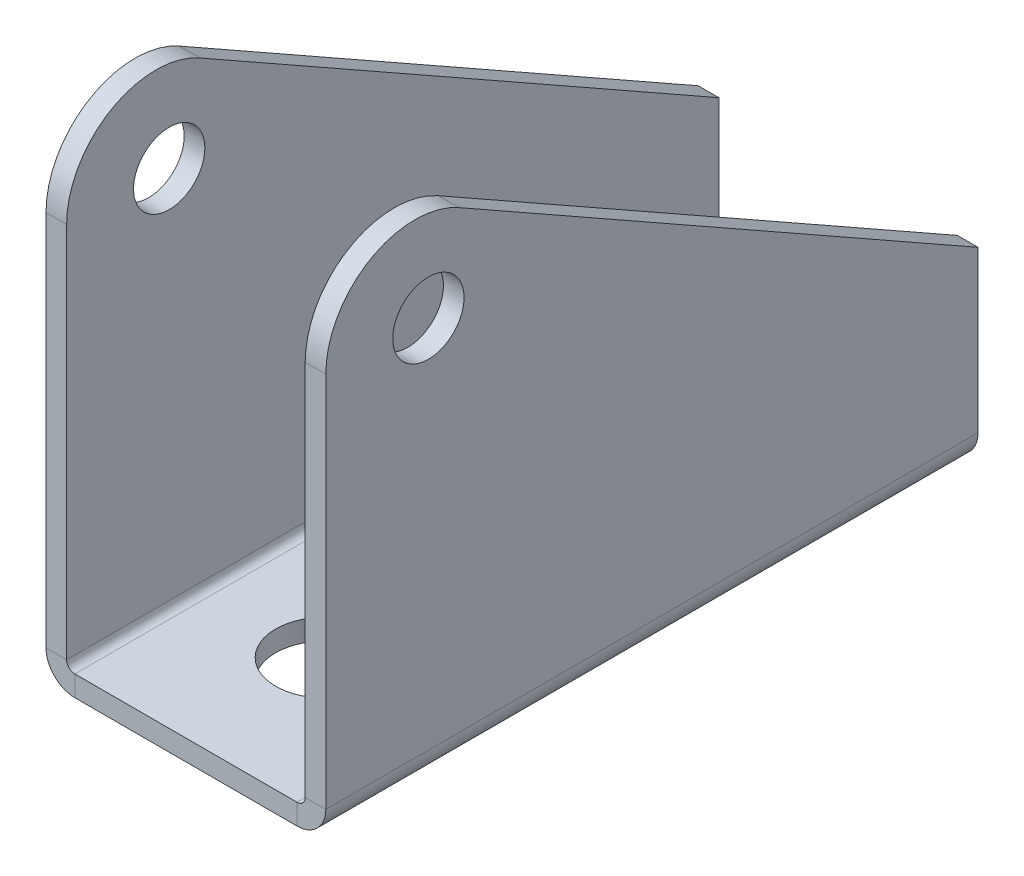
ISO-10303-21;
HEADER;
FILE_DESCRIPTION(('STEP AP214'),'2;1');
FILE_NAME('part.step','',(''),(''),'','','');
FILE_SCHEMA(('AUTOMOTIVE_DESIGN { 1 0 10303 214 1 1 1 1 }'));
ENDSEC;
DATA;
#1=APPLICATION_CONTEXT('core data for automotive mechanical design processes');
#2=APPLICATION_PROTOCOL_DEFINITION('international standard','automotive_design',2000,#1);
#3=PRODUCT_CONTEXT('',#1,'mechanical');
#4=PRODUCT('Part','Part','',(#3));
#5=PRODUCT_RELATED_PRODUCT_CATEGORY('part','',(#4));
#6=PRODUCT_DEFINITION_FORMATION('','',#4);
#7=PRODUCT_DEFINITION_CONTEXT('part definition',#1,'design');
#8=PRODUCT_DEFINITION('design','',#6,#7);
#9=PRODUCT_DEFINITION_SHAPE('','',#8);
#10=(LENGTH_UNIT() NAMED_UNIT(*) SI_UNIT(.MILLI.,.METRE.));
#11=(NAMED_UNIT(*) PLANE_ANGLE_UNIT() SI_UNIT($,.RADIAN.));
#12=(NAMED_UNIT(*) SI_UNIT($,.STERADIAN.) SOLID_ANGLE_UNIT());
#13=UNCERTAINTY_MEASURE_WITH_UNIT(LENGTH_MEASURE(1.E-05),#10,'distance_accuracy_value','');
#14=(GEOMETRIC_REPRESENTATION_CONTEXT(3) GLOBAL_UNCERTAINTY_ASSIGNED_CONTEXT((#13)) GLOBAL_UNIT_ASSIGNED_CONTEXT((#10,
#11,#12)) REPRESENTATION_CONTEXT('',''));
#15=CARTESIAN_POINT('',(0.,0.,0.));
#16=DIRECTION('',(0.,0.,1.));
#17=DIRECTION('',(1.,0.,0.));
#18=AXIS2_PLACEMENT_3D('',#15,#16,#17);
#19=CARTESIAN_POINT('',(9.96340000000001,2.5866,-58.5));
#20=DIRECTION('',(0.,0.,1.));
#21=DIRECTION('',(1.,0.,0.));
#22=AXIS2_PLACEMENT_3D('',#19,#20,#21);
#23=PLANE('',#22);
#24=DIRECTION('',(0.,-1.,0.));
#25=VECTOR('',#24,1.);
#26=CARTESIAN_POINT('',(5.05,44.4,-58.5));
#27=LINE('',#26,#25);
#28=CARTESIAN_POINT('',(5.05,1.85,-58.5));
#29=VERTEX_POINT('',#28);
#30=CARTESIAN_POINT('',(5.05,0.,-58.5));
#31=VERTEX_POINT('',#30);
#32=EDGE_CURVE('E383',#29,#31,#27,.T.);
#33=ORIENTED_EDGE('',*,*,#32,.F.);
#34=DIRECTION('',(1.,0.,0.));
#35=VECTOR('',#34,1.);
#36=CARTESIAN_POINT('',(0.,1.85,-58.5));
#37=LINE('',#36,#35);
#38=CARTESIAN_POINT('',(9.96340000000001,1.85,-58.5));
#39=VERTEX_POINT('',#38);
#40=EDGE_CURVE('E340',#29,#39,#37,.T.);
#41=ORIENTED_EDGE('',*,*,#40,.T.);
#42=DIRECTION('',(0.,-1.,0.));
#43=VECTOR('',#42,1.);
#44=CARTESIAN_POINT('',(9.96340000000001,1.85,-58.5));
#45=LINE('',#44,#43);
#46=CARTESIAN_POINT('',(9.96340000000001,0.,-58.5));
#47=VERTEX_POINT('',#46);
#48=EDGE_CURVE('E376',#39,#47,#45,.T.);
#49=ORIENTED_EDGE('',*,*,#48,.T.);
#50=DIRECTION('',(1.,0.,0.));
#51=VECTOR('',#50,1.);
#52=CARTESIAN_POINT('',(0.,0.,-58.5));
#53=LINE('',#52,#51);
#54=EDGE_CURVE('E342',#31,#47,#53,.T.);
#55=ORIENTED_EDGE('',*,*,#54,.F.);
#56=EDGE_LOOP('',(#33,#41,#49,#55));
#57=FACE_BOUND('',#56,.T.);
#58=ADVANCED_FACE('F68',(#57),#23,.F.);
#59=CARTESIAN_POINT('',(12.55,0.,-58.5));
#60=DIRECTION('',(1.,0.,0.));
#61=DIRECTION('',(0.,0.,-1.));
#62=AXIS2_PLACEMENT_3D('',#59,#60,#61);
#63=PLANE('',#62);
#64=CARTESIAN_POINT('',(12.55,36.4,-8.));
#65=DIRECTION('',(1.,0.,0.));
#66=DIRECTION('',(0.,0.,-1.));
#67=AXIS2_PLACEMENT_3D('',#64,#65,#66);
#68=CIRCLE('',#67,8.);
#69=CARTESIAN_POINT('',(12.55,43.3615559331784,-11.9416670317556));
#70=VERTEX_POINT('',#69);
#71=CARTESIAN_POINT('',(12.55,36.4,0.));
#72=VERTEX_POINT('',#71);
#73=EDGE_CURVE('E318',#70,#72,#68,.T.);
#74=ORIENTED_EDGE('',*,*,#73,.T.);
#75=DIRECTION('',(0.,1.,0.));
#76=VECTOR('',#75,1.);
#77=CARTESIAN_POINT('',(12.55,0.,0.));
#78=LINE('',#77,#76);
#79=CARTESIAN_POINT('',(12.55,2.5866,0.));
#80=VERTEX_POINT('',#79);
#81=EDGE_CURVE('E331',#80,#72,#78,.T.);
#82=ORIENTED_EDGE('',*,*,#81,.F.);
#83=DIRECTION('',(0.,0.,1.));
#84=VECTOR('',#83,1.);
#85=CARTESIAN_POINT('',(12.55,2.5866,-58.5));
#86=LINE('',#85,#84);
#87=CARTESIAN_POINT('',(12.55,2.5866,-58.5));
#88=VERTEX_POINT('',#87);
#89=EDGE_CURVE('E363',#88,#80,#86,.T.);
#90=ORIENTED_EDGE('',*,*,#89,.F.);
#91=DIRECTION('',(0.,1.,0.));
#92=VECTOR('',#91,1.);
#93=CARTESIAN_POINT('',(12.55,0.,-58.5));
#94=LINE('',#93,#92);
#95=CARTESIAN_POINT('',(12.55,17.,-58.5));
#96=VERTEX_POINT('',#95);
#97=EDGE_CURVE('E332',#88,#96,#94,.T.);
#98=ORIENTED_EDGE('',*,*,#97,.T.);
#99=DIRECTION('',(0.,0.492708378969455,0.870194491647293));
#100=VECTOR('',#99,1.);
#101=CARTESIAN_POINT('',(12.55,37.9550525719957,-21.4903364775931));
#102=LINE('',#101,#100);
#103=EDGE_CURVE('E320',#96,#70,#102,.T.);
#104=ORIENTED_EDGE('',*,*,#103,.T.);
#105=EDGE_LOOP('',(#74,#82,#90,#98,#104));
#106=FACE_BOUND('',#105,.T.);
#107=CARTESIAN_POINT('',(12.55,36.15,-9.2));
#108=DIRECTION('',(1.,0.,0.));
#109=DIRECTION('',(0.,0.,-1.));
#110=AXIS2_PLACEMENT_3D('',#107,#108,#109);
#111=CIRCLE('',#110,3.2);
#112=CARTESIAN_POINT('',(12.55,36.15,-12.4));
#113=VERTEX_POINT('',#112);
#114=EDGE_CURVE('E311',#113,#113,#111,.T.);
#115=ORIENTED_EDGE('',*,*,#114,.F.);
#116=EDGE_LOOP('',(#115));
#117=FACE_BOUND('',#116,.T.);
#118=ADVANCED_FACE('F458',(#106,#117),#63,.T.);
#119=CARTESIAN_POINT('',(10.7,0.,-58.5));
#120=DIRECTION('',(1.,0.,0.));
#121=DIRECTION('',(0.,0.,-1.));
#122=AXIS2_PLACEMENT_3D('',#119,#120,#121);
#123=PLANE('',#122);
#124=DIRECTION('',(0.,1.,0.));
#125=VECTOR('',#124,1.);
#126=CARTESIAN_POINT('',(10.7,0.,0.));
#127=LINE('',#126,#125);
#128=CARTESIAN_POINT('',(10.7,2.5866,0.));
#129=VERTEX_POINT('',#128);
#130=CARTESIAN_POINT('',(10.7,36.4,0.));
#131=VERTEX_POINT('',#130);
#132=EDGE_CURVE('E349',#129,#131,#127,.T.);
#133=ORIENTED_EDGE('',*,*,#132,.T.);
#134=CARTESIAN_POINT('',(10.7,36.4,-8.));
#135=DIRECTION('',(1.,0.,0.));
#136=DIRECTION('',(0.,0.,-1.));
#137=AXIS2_PLACEMENT_3D('',#134,#135,#136);
#138=CIRCLE('',#137,8.);
#139=CARTESIAN_POINT('',(10.7,43.3615559331784,-11.9416670317556));
#140=VERTEX_POINT('',#139);
#141=EDGE_CURVE('E328',#131,#140,#138,.F.);
#142=ORIENTED_EDGE('',*,*,#141,.T.);
#143=DIRECTION('',(0.,-0.492708378969456,-0.870194491647294));
#144=VECTOR('',#143,1.);
#145=CARTESIAN_POINT('',(10.7,12.873053705986,-65.7887859952507));
#146=LINE('',#145,#144);
#147=CARTESIAN_POINT('',(10.7,17.,-58.5));
#148=VERTEX_POINT('',#147);
#149=EDGE_CURVE('E380',#140,#148,#146,.T.);
#150=ORIENTED_EDGE('',*,*,#149,.T.);
#151=DIRECTION('',(0.,1.,0.));
#152=VECTOR('',#151,1.);
#153=CARTESIAN_POINT('',(10.7,0.,-58.5));
#154=LINE('',#153,#152);
#155=CARTESIAN_POINT('',(10.7,2.5866,-58.5));
#156=VERTEX_POINT('',#155);
#157=EDGE_CURVE('E335',#156,#148,#154,.T.);
#158=ORIENTED_EDGE('',*,*,#157,.F.);
#159=DIRECTION('',(0.,0.,1.));
#160=VECTOR('',#159,1.);
#161=CARTESIAN_POINT('',(10.7,2.5866,-58.5));
#162=LINE('',#161,#160);
#163=EDGE_CURVE('E347',#156,#129,#162,.T.);
#164=ORIENTED_EDGE('',*,*,#163,.T.);
#165=EDGE_LOOP('',(#133,#142,#150,#158,#164));
#166=FACE_BOUND('',#165,.T.);
#167=CARTESIAN_POINT('',(10.7,36.15,-9.2));
#168=DIRECTION('',(1.,0.,0.));
#169=DIRECTION('',(0.,0.,-1.));
#170=AXIS2_PLACEMENT_3D('',#167,#168,#169);
#171=CIRCLE('',#170,3.2);
#172=CARTESIAN_POINT('',(10.7,36.15,-12.4));
#173=VERTEX_POINT('',#172);
#174=EDGE_CURVE('E317',#173,#173,#171,.F.);
#175=ORIENTED_EDGE('',*,*,#174,.F.);
#176=EDGE_LOOP('',(#175));
#177=FACE_BOUND('',#176,.T.);
#178=ADVANCED_FACE('F466',(#166,#177),#123,.F.);
#179=CARTESIAN_POINT('',(12.55,2.5866,-58.5));
#180=DIRECTION('',(0.,0.,-1.));
#181=DIRECTION('',(-1.,0.,0.));
#182=AXIS2_PLACEMENT_3D('',#179,#180,#181);
#183=PLANE('',#182);
#184=DIRECTION('',(-1.,0.,0.));
#185=VECTOR('',#184,1.);
#186=CARTESIAN_POINT('',(12.55,2.5866,-58.5));
#187=LINE('',#186,#185);
#188=EDGE_CURVE('E92',#88,#156,#187,.T.);
#189=ORIENTED_EDGE('',*,*,#188,.F.);
#190=CARTESIAN_POINT('',(9.96340000000001,2.5866,-58.5));
#191=DIRECTION('',(0.,0.,-1.));
#192=DIRECTION('',(-1.,0.,0.));
#193=AXIS2_PLACEMENT_3D('',#190,#191,#192);
#194=CIRCLE('',#193,2.5866);
#195=EDGE_CURVE('E344',#47,#88,#194,.F.);
#196=ORIENTED_EDGE('',*,*,#195,.F.);
#197=ORIENTED_EDGE('',*,*,#48,.F.);
#198=CARTESIAN_POINT('',(9.96340000000001,2.5866,-58.5));
#199=DIRECTION('',(0.,0.,1.));
#200=DIRECTION('',(1.,0.,0.));
#201=AXIS2_PLACEMENT_3D('',#198,#199,#200);
#202=CIRCLE('',#201,0.7366);
#203=EDGE_CURVE('E338',#39,#156,#202,.T.);
#204=ORIENTED_EDGE('',*,*,#203,.T.);
#205=EDGE_LOOP('',(#189,#196,#197,#204));
#206=FACE_BOUND('',#205,.T.);
#207=ADVANCED_FACE('F70',(#206),#183,.T.);
#208=CARTESIAN_POINT('',(9.96340000000001,1.85,-58.5));
#209=DIRECTION('',(0.,0.,-1.));
#210=DIRECTION('',(-1.,0.,0.));
#211=AXIS2_PLACEMENT_3D('',#208,#209,#210);
#212=PLANE('',#211);
#213=DIRECTION('',(-1.,0.,0.));
#214=VECTOR('',#213,1.);
#215=CARTESIAN_POINT('',(12.55,17.,-58.5));
#216=LINE('',#215,#214);
#217=EDGE_CURVE('E323',#96,#148,#216,.T.);
#218=ORIENTED_EDGE('',*,*,#217,.F.);
#219=ORIENTED_EDGE('',*,*,#97,.F.);
#220=ORIENTED_EDGE('',*,*,#188,.T.);
#221=ORIENTED_EDGE('',*,*,#157,.T.);
#222=EDGE_LOOP('',(#218,#219,#220,#221));
#223=FACE_BOUND('',#222,.T.);
#224=ADVANCED_FACE('F494',(#223),#212,.T.);
#225=CARTESIAN_POINT('',(9.96340000000001,0.,0.));
#226=DIRECTION('',(0.,0.,1.));
#227=DIRECTION('',(1.,0.,0.));
#228=AXIS2_PLACEMENT_3D('',#225,#226,#227);
#229=PLANE('',#228);
#230=DIRECTION('',(0.,1.,0.));
#231=VECTOR('',#230,1.);
#232=CARTESIAN_POINT('',(9.96340000000001,0.,0.));
#233=LINE('',#232,#231);
#234=CARTESIAN_POINT('',(9.96340000000001,0.,0.));
#235=VERTEX_POINT('',#234);
#236=CARTESIAN_POINT('',(9.96340000000001,1.85,0.));
#237=VERTEX_POINT('',#236);
#238=EDGE_CURVE('E374',#235,#237,#233,.T.);
#239=ORIENTED_EDGE('',*,*,#238,.F.);
#240=CARTESIAN_POINT('',(9.96340000000001,2.5866,0.));
#241=DIRECTION('',(0.,0.,-1.));
#242=DIRECTION('',(-1.,0.,0.));
#243=AXIS2_PLACEMENT_3D('',#240,#241,#242);
#244=CIRCLE('',#243,2.5866);
#245=EDGE_CURVE('E336',#235,#80,#244,.F.);
#246=ORIENTED_EDGE('',*,*,#245,.T.);
#247=DIRECTION('',(1.,0.,0.));
#248=VECTOR('',#247,1.);
#249=CARTESIAN_POINT('',(10.7,2.5866,0.));
#250=LINE('',#249,#248);
#251=EDGE_CURVE('E114',#129,#80,#250,.T.);
#252=ORIENTED_EDGE('',*,*,#251,.F.);
#253=CARTESIAN_POINT('',(9.96340000000001,2.5866,0.));
#254=DIRECTION('',(0.,0.,1.));
#255=DIRECTION('',(1.,0.,0.));
#256=AXIS2_PLACEMENT_3D('',#253,#254,#255);
#257=CIRCLE('',#256,0.7366);
#258=EDGE_CURVE('E352',#237,#129,#257,.T.);
#259=ORIENTED_EDGE('',*,*,#258,.F.);
#260=EDGE_LOOP('',(#239,#246,#252,#259));
#261=FACE_BOUND('',#260,.T.);
#262=ADVANCED_FACE('F492',(#261),#229,.T.);
#263=CARTESIAN_POINT('',(10.7,2.5866,0.));
#264=DIRECTION('',(0.,0.,1.));
#265=DIRECTION('',(1.,0.,0.));
#266=AXIS2_PLACEMENT_3D('',#263,#264,#265);
#267=PLANE('',#266);
#268=DIRECTION('',(1.,0.,0.));
#269=VECTOR('',#268,1.);
#270=CARTESIAN_POINT('',(0.,0.,0.));
#271=LINE('',#270,#269);
#272=CARTESIAN_POINT('',(-9.96340000000001,0.,0.));
#273=VERTEX_POINT('',#272);
#274=EDGE_CURVE('E358',#273,#235,#271,.T.);
#275=ORIENTED_EDGE('',*,*,#274,.T.);
#276=ORIENTED_EDGE('',*,*,#238,.T.);
#277=DIRECTION('',(1.,0.,0.));
#278=VECTOR('',#277,1.);
#279=CARTESIAN_POINT('',(0.,1.85,0.));
#280=LINE('',#279,#278);
#281=CARTESIAN_POINT('',(-9.96340000000001,1.85,0.));
#282=VERTEX_POINT('',#281);
#283=EDGE_CURVE('E355',#282,#237,#280,.T.);
#284=ORIENTED_EDGE('',*,*,#283,.F.);
#285=DIRECTION('',(0.,1.,0.));
#286=VECTOR('',#285,1.);
#287=CARTESIAN_POINT('',(-9.96340000000001,0.,0.));
#288=LINE('',#287,#286);
#289=EDGE_CURVE('E290',#273,#282,#288,.T.);
#290=ORIENTED_EDGE('',*,*,#289,.F.);
#291=EDGE_LOOP('',(#275,#276,#284,#290));
#292=FACE_BOUND('',#291,.T.);
#293=ADVANCED_FACE('F404',(#292),#267,.T.);
#294=CARTESIAN_POINT('',(9.96340000000001,2.5866,-58.5));
#295=DIRECTION('',(0.,0.,1.));
#296=DIRECTION('',(1.,0.,0.));
#297=AXIS2_PLACEMENT_3D('',#294,#295,#296);
#298=CYLINDRICAL_SURFACE('',#297,2.5866);
#299=ORIENTED_EDGE('',*,*,#245,.F.);
#300=DIRECTION('',(0.,0.,1.));
#301=VECTOR('',#300,1.);
#302=CARTESIAN_POINT('',(9.96340000000001,0.,-58.5));
#303=LINE('',#302,#301);
#304=EDGE_CURVE('E365',#47,#235,#303,.T.);
#305=ORIENTED_EDGE('',*,*,#304,.F.);
#306=ORIENTED_EDGE('',*,*,#195,.T.);
#307=ORIENTED_EDGE('',*,*,#89,.T.);
#308=EDGE_LOOP('',(#299,#305,#306,#307));
#309=FACE_BOUND('',#308,.T.);
#310=ADVANCED_FACE('F400',(#309),#298,.T.);
#311=CARTESIAN_POINT('',(0.,0.,-58.5));
#312=DIRECTION('',(0.,-1.,0.));
#313=DIRECTION('',(0.,0.,-1.));
#314=AXIS2_PLACEMENT_3D('',#311,#312,#313);
#315=PLANE('',#314);
#316=ORIENTED_EDGE('',*,*,#274,.F.);
#317=DIRECTION('',(0.,0.,1.));
#318=VECTOR('',#317,1.);
#319=CARTESIAN_POINT('',(-9.96340000000001,0.,-58.5));
#320=LINE('',#319,#318);
#321=CARTESIAN_POINT('',(-9.96340000000001,0.,-58.5));
#322=VERTEX_POINT('',#321);
#323=EDGE_CURVE('E280',#322,#273,#320,.T.);
#324=ORIENTED_EDGE('',*,*,#323,.F.);
#325=DIRECTION('',(-1.,0.,0.));
#326=VECTOR('',#325,1.);
#327=CARTESIAN_POINT('',(0.,0.,-58.5));
#328=LINE('',#327,#326);
#329=CARTESIAN_POINT('',(-5.05,0.,-58.5));
#330=VERTEX_POINT('',#329);
#331=EDGE_CURVE('E226',#330,#322,#328,.T.);
#332=ORIENTED_EDGE('',*,*,#331,.F.);
#333=DIRECTION('',(0.,0.,-1.));
#334=VECTOR('',#333,1.);
#335=CARTESIAN_POINT('',(-5.05,0.,-49.4));
#336=LINE('',#335,#334);
#337=CARTESIAN_POINT('',(-5.05,0.,-49.4));
#338=VERTEX_POINT('',#337);
#339=EDGE_CURVE('E219',#338,#330,#336,.T.);
#340=ORIENTED_EDGE('',*,*,#339,.F.);
#341=CARTESIAN_POINT('',(0.,0.,-49.4));
#342=DIRECTION('',(0.,1.,0.));
#343=DIRECTION('',(0.,0.,1.));
#344=AXIS2_PLACEMENT_3D('',#341,#342,#343);
#345=CIRCLE('',#344,5.05);
#346=CARTESIAN_POINT('',(5.05,0.,-49.4));
#347=VERTEX_POINT('',#346);
#348=EDGE_CURVE('E203',#338,#347,#345,.T.);
#349=ORIENTED_EDGE('',*,*,#348,.T.);
#350=DIRECTION('',(0.,0.,-1.));
#351=VECTOR('',#350,1.);
#352=CARTESIAN_POINT('',(5.05,0.,-49.4));
#353=LINE('',#352,#351);
#354=EDGE_CURVE('E213',#347,#31,#353,.T.);
#355=ORIENTED_EDGE('',*,*,#354,.T.);
#356=ORIENTED_EDGE('',*,*,#54,.T.);
#357=ORIENTED_EDGE('',*,*,#304,.T.);
#358=EDGE_LOOP('',(#316,#324,#332,#340,#349,#355,#356,#357));
#359=FACE_BOUND('',#358,.T.);
#360=CARTESIAN_POINT('',(0.,0.,-12.5));
#361=DIRECTION('',(0.,1.,0.));
#362=DIRECTION('',(0.,0.,1.));
#363=AXIS2_PLACEMENT_3D('',#360,#361,#362);
#364=CIRCLE('',#363,4.45);
#365=CARTESIAN_POINT('',(0.,0.,-8.05));
#366=VERTEX_POINT('',#365);
#367=EDGE_CURVE('E305',#366,#366,#364,.T.);
#368=ORIENTED_EDGE('',*,*,#367,.T.);
#369=EDGE_LOOP('',(#368));
#370=FACE_BOUND('',#369,.T.);
#371=ADVANCED_FACE('F223',(#359,#370),#315,.T.);
#372=CARTESIAN_POINT('',(0.,1.85,-58.5));
#373=DIRECTION('',(0.,-1.,0.));
#374=DIRECTION('',(0.,0.,-1.));
#375=AXIS2_PLACEMENT_3D('',#372,#373,#374);
#376=PLANE('',#375);
#377=DIRECTION('',(0.,0.,1.));
#378=VECTOR('',#377,1.);
#379=CARTESIAN_POINT('',(-9.96340000000001,1.85,-58.5));
#380=LINE('',#379,#378);
#381=CARTESIAN_POINT('',(-9.96340000000001,1.85,-58.5));
#382=VERTEX_POINT('',#381);
#383=EDGE_CURVE('E283',#382,#282,#380,.T.);
#384=ORIENTED_EDGE('',*,*,#383,.T.);
#385=ORIENTED_EDGE('',*,*,#283,.T.);
#386=DIRECTION('',(0.,0.,1.));
#387=VECTOR('',#386,1.);
#388=CARTESIAN_POINT('',(9.96340000000001,1.85,-58.5));
#389=LINE('',#388,#387);
#390=EDGE_CURVE('E368',#39,#237,#389,.T.);
#391=ORIENTED_EDGE('',*,*,#390,.F.);
#392=ORIENTED_EDGE('',*,*,#40,.F.);
#393=DIRECTION('',(0.,0.,-1.));
#394=VECTOR('',#393,1.);
#395=CARTESIAN_POINT('',(5.05,1.85,-58.5));
#396=LINE('',#395,#394);
#397=CARTESIAN_POINT('',(5.05,1.85,-49.4));
#398=VERTEX_POINT('',#397);
#399=EDGE_CURVE('E83',#398,#29,#396,.T.);
#400=ORIENTED_EDGE('',*,*,#399,.F.);
#401=CARTESIAN_POINT('',(0.,1.85,-49.4));
#402=DIRECTION('',(0.,-1.,0.));
#403=DIRECTION('',(0.,0.,-1.));
#404=AXIS2_PLACEMENT_3D('',#401,#402,#403);
#405=CIRCLE('',#404,5.05);
#406=CARTESIAN_POINT('',(-5.05,1.85,-49.4));
#407=VERTEX_POINT('',#406);
#408=EDGE_CURVE('E76',#407,#398,#405,.F.);
#409=ORIENTED_EDGE('',*,*,#408,.F.);
#410=DIRECTION('',(0.,0.,-1.));
#411=VECTOR('',#410,1.);
#412=CARTESIAN_POINT('',(-5.05,1.85,-58.5));
#413=LINE('',#412,#411);
#414=CARTESIAN_POINT('',(-5.05,1.85,-58.5));
#415=VERTEX_POINT('',#414);
#416=EDGE_CURVE('E221',#407,#415,#413,.T.);
#417=ORIENTED_EDGE('',*,*,#416,.T.);
#418=DIRECTION('',(-1.,0.,0.));
#419=VECTOR('',#418,1.);
#420=CARTESIAN_POINT('',(0.,1.85,-58.5));
#421=LINE('',#420,#419);
#422=EDGE_CURVE('E260',#415,#382,#421,.T.);
#423=ORIENTED_EDGE('',*,*,#422,.T.);
#424=EDGE_LOOP('',(#384,#385,#391,#392,#400,#409,#417,#423));
#425=FACE_BOUND('',#424,.T.);
#426=CARTESIAN_POINT('',(0.,1.85,-12.5));
#427=DIRECTION('',(0.,-1.,0.));
#428=DIRECTION('',(0.,0.,-1.));
#429=AXIS2_PLACEMENT_3D('',#426,#427,#428);
#430=CIRCLE('',#429,4.45);
#431=CARTESIAN_POINT('',(0.,1.85,-16.95));
#432=VERTEX_POINT('',#431);
#433=EDGE_CURVE('E12',#432,#432,#430,.F.);
#434=ORIENTED_EDGE('',*,*,#433,.F.);
#435=EDGE_LOOP('',(#434));
#436=FACE_BOUND('',#435,.T.);
#437=ADVANCED_FACE('F389',(#425,#436),#376,.F.);
#438=CARTESIAN_POINT('',(9.96340000000001,2.5866,-58.5));
#439=DIRECTION('',(0.,0.,1.));
#440=DIRECTION('',(1.,0.,0.));
#441=AXIS2_PLACEMENT_3D('',#438,#439,#440);
#442=CYLINDRICAL_SURFACE('',#441,0.7366);
#443=ORIENTED_EDGE('',*,*,#258,.T.);
#444=ORIENTED_EDGE('',*,*,#163,.F.);
#445=ORIENTED_EDGE('',*,*,#203,.F.);
#446=ORIENTED_EDGE('',*,*,#390,.T.);
#447=EDGE_LOOP('',(#443,#444,#445,#446));
#448=FACE_BOUND('',#447,.T.);
#449=ADVANCED_FACE('F477',(#448),#442,.F.);
#450=CARTESIAN_POINT('',(9.96340000000001,2.5866,0.));
#451=DIRECTION('',(0.,0.,1.));
#452=DIRECTION('',(1.,0.,0.));
#453=AXIS2_PLACEMENT_3D('',#450,#451,#452);
#454=PLANE('',#453);
#455=DIRECTION('',(-1.,0.,0.));
#456=VECTOR('',#455,1.);
#457=CARTESIAN_POINT('',(12.55,36.4,0.));
#458=LINE('',#457,#456);
#459=EDGE_CURVE('E314',#72,#131,#458,.T.);
#460=ORIENTED_EDGE('',*,*,#459,.T.);
#461=ORIENTED_EDGE('',*,*,#132,.F.);
#462=ORIENTED_EDGE('',*,*,#251,.T.);
#463=ORIENTED_EDGE('',*,*,#81,.T.);
#464=EDGE_LOOP('',(#460,#461,#462,#463));
#465=FACE_BOUND('',#464,.T.);
#466=ADVANCED_FACE('F473',(#465),#454,.T.);
#467=CARTESIAN_POINT('',(12.55,37.9550525719957,-21.4903364775931));
#468=DIRECTION('',(0.,-0.870194491647294,0.492708378969456));
#469=DIRECTION('',(0.,-0.492708378969456,-0.870194491647294));
#470=AXIS2_PLACEMENT_3D('',#467,#468,#469);
#471=PLANE('',#470);
#472=DIRECTION('',(-1.,0.,0.));
#473=VECTOR('',#472,1.);
#474=CARTESIAN_POINT('',(12.55,43.3615559331784,-11.9416670317556));
#475=LINE('',#474,#473);
#476=EDGE_CURVE('E325',#70,#140,#475,.T.);
#477=ORIENTED_EDGE('',*,*,#476,.F.);
#478=ORIENTED_EDGE('',*,*,#103,.F.);
#479=ORIENTED_EDGE('',*,*,#217,.T.);
#480=ORIENTED_EDGE('',*,*,#149,.F.);
#481=EDGE_LOOP('',(#477,#478,#479,#480));
#482=FACE_BOUND('',#481,.T.);
#483=ADVANCED_FACE('F476',(#482),#471,.F.);
#484=CARTESIAN_POINT('',(12.55,36.4,-8.));
#485=DIRECTION('',(-1.,0.,0.));
#486=DIRECTION('',(0.,0.,1.));
#487=AXIS2_PLACEMENT_3D('',#484,#485,#486);
#488=CYLINDRICAL_SURFACE('',#487,8.);
#489=ORIENTED_EDGE('',*,*,#141,.F.);
#490=ORIENTED_EDGE('',*,*,#459,.F.);
#491=ORIENTED_EDGE('',*,*,#73,.F.);
#492=ORIENTED_EDGE('',*,*,#476,.T.);
#493=EDGE_LOOP('',(#489,#490,#491,#492));
#494=FACE_BOUND('',#493,.T.);
#495=ADVANCED_FACE('F471',(#494),#488,.T.);
#496=CARTESIAN_POINT('',(12.55,36.15,-9.2));
#497=DIRECTION('',(-1.,0.,0.));
#498=DIRECTION('',(0.,0.,1.));
#499=AXIS2_PLACEMENT_3D('',#496,#497,#498);
#500=CYLINDRICAL_SURFACE('',#499,3.2);
#501=ORIENTED_EDGE('',*,*,#114,.T.);
#502=EDGE_LOOP('',(#501));
#503=FACE_BOUND('',#502,.T.);
#504=ORIENTED_EDGE('',*,*,#174,.T.);
#505=EDGE_LOOP('',(#504));
#506=FACE_BOUND('',#505,.T.);
#507=ADVANCED_FACE('F514',(#503,#506),#500,.F.);
#508=CARTESIAN_POINT('',(0.,44.4,-49.4));
#509=DIRECTION('',(0.,-1.,0.));
#510=DIRECTION('',(0.,0.,-1.));
#511=AXIS2_PLACEMENT_3D('',#508,#509,#510);
#512=CYLINDRICAL_SURFACE('',#511,5.05);
#513=ORIENTED_EDGE('',*,*,#348,.F.);
#514=DIRECTION('',(0.,-1.,0.));
#515=VECTOR('',#514,1.);
#516=CARTESIAN_POINT('',(-5.05,44.4,-49.4));
#517=LINE('',#516,#515);
#518=EDGE_CURVE('E206',#407,#338,#517,.T.);
#519=ORIENTED_EDGE('',*,*,#518,.F.);
#520=ORIENTED_EDGE('',*,*,#408,.T.);
#521=DIRECTION('',(0.,-1.,0.));
#522=VECTOR('',#521,1.);
#523=CARTESIAN_POINT('',(5.05,44.4,-49.4));
#524=LINE('',#523,#522);
#525=EDGE_CURVE('E208',#398,#347,#524,.T.);
#526=ORIENTED_EDGE('',*,*,#525,.T.);
#527=EDGE_LOOP('',(#513,#519,#520,#526));
#528=FACE_BOUND('',#527,.T.);
#529=ADVANCED_FACE('F205',(#528),#512,.F.);
#530=CARTESIAN_POINT('',(5.05,44.4,-49.4));
#531=DIRECTION('',(-1.,0.,0.));
#532=DIRECTION('',(0.,0.,1.));
#533=AXIS2_PLACEMENT_3D('',#530,#531,#532);
#534=PLANE('',#533);
#535=ORIENTED_EDGE('',*,*,#399,.T.);
#536=ORIENTED_EDGE('',*,*,#32,.T.);
#537=ORIENTED_EDGE('',*,*,#354,.F.);
#538=ORIENTED_EDGE('',*,*,#525,.F.);
#539=EDGE_LOOP('',(#535,#536,#537,#538));
#540=FACE_BOUND('',#539,.T.);
#541=ADVANCED_FACE('F387',(#540),#534,.T.);
#542=CARTESIAN_POINT('',(0.,44.4,-12.5));
#543=DIRECTION('',(0.,-1.,0.));
#544=DIRECTION('',(0.,0.,-1.));
#545=AXIS2_PLACEMENT_3D('',#542,#543,#544);
#546=CYLINDRICAL_SURFACE('',#545,4.45);
#547=ORIENTED_EDGE('',*,*,#433,.T.);
#548=EDGE_LOOP('',(#547));
#549=FACE_BOUND('',#548,.T.);
#550=ORIENTED_EDGE('',*,*,#367,.F.);
#551=EDGE_LOOP('',(#550));
#552=FACE_BOUND('',#551,.T.);
#553=ADVANCED_FACE('F523',(#549,#552),#546,.F.);
#554=CARTESIAN_POINT('',(-9.96340000000001,2.5866,-58.5));
#555=DIRECTION('',(0.,0.,1.));
#556=DIRECTION('',(-1.,0.,0.));
#557=AXIS2_PLACEMENT_3D('',#554,#555,#556);
#558=PLANE('',#557);
#559=DIRECTION('',(0.,-1.,0.));
#560=VECTOR('',#559,1.);
#561=CARTESIAN_POINT('',(-5.05,44.4,-58.5));
#562=LINE('',#561,#560);
#563=EDGE_CURVE('E214',#415,#330,#562,.T.);
#564=ORIENTED_EDGE('',*,*,#563,.T.);
#565=ORIENTED_EDGE('',*,*,#331,.T.);
#566=DIRECTION('',(0.,-1.,0.));
#567=VECTOR('',#566,1.);
#568=CARTESIAN_POINT('',(-9.96340000000001,1.85,-58.5));
#569=LINE('',#568,#567);
#570=EDGE_CURVE('E293',#382,#322,#569,.T.);
#571=ORIENTED_EDGE('',*,*,#570,.F.);
#572=ORIENTED_EDGE('',*,*,#422,.F.);
#573=EDGE_LOOP('',(#564,#565,#571,#572));
#574=FACE_BOUND('',#573,.T.);
#575=ADVANCED_FACE('F422',(#574),#558,.F.);
#576=CARTESIAN_POINT('',(-12.55,0.,-58.5));
#577=DIRECTION('',(-1.,0.,0.));
#578=DIRECTION('',(0.,0.,-1.));
#579=AXIS2_PLACEMENT_3D('',#576,#577,#578);
#580=PLANE('',#579);
#581=CARTESIAN_POINT('',(-12.55,36.4,-8.));
#582=DIRECTION('',(1.,0.,0.));
#583=DIRECTION('',(0.,0.,-1.));
#584=AXIS2_PLACEMENT_3D('',#581,#582,#583);
#585=CIRCLE('',#584,8.);
#586=CARTESIAN_POINT('',(-12.55,43.3615559331784,-11.9416670317556));
#587=VERTEX_POINT('',#586);
#588=CARTESIAN_POINT('',(-12.55,36.4,0.));
#589=VERTEX_POINT('',#588);
#590=EDGE_CURVE('E237',#587,#589,#585,.T.);
#591=ORIENTED_EDGE('',*,*,#590,.F.);
#592=DIRECTION('',(0.,0.492708378969455,0.870194491647293));
#593=VECTOR('',#592,1.);
#594=CARTESIAN_POINT('',(-12.55,37.9550525719957,-21.4903364775931));
#595=LINE('',#594,#593);
#596=CARTESIAN_POINT('',(-12.55,17.,-58.5));
#597=VERTEX_POINT('',#596);
#598=EDGE_CURVE('E240',#597,#587,#595,.T.);
#599=ORIENTED_EDGE('',*,*,#598,.F.);
#600=DIRECTION('',(0.,1.,0.));
#601=VECTOR('',#600,1.);
#602=CARTESIAN_POINT('',(-12.55,0.,-58.5));
#603=LINE('',#602,#601);
#604=CARTESIAN_POINT('',(-12.55,2.5866,-58.5));
#605=VERTEX_POINT('',#604);
#606=EDGE_CURVE('E251',#605,#597,#603,.T.);
#607=ORIENTED_EDGE('',*,*,#606,.F.);
#608=DIRECTION('',(0.,0.,1.));
#609=VECTOR('',#608,1.);
#610=CARTESIAN_POINT('',(-12.55,2.5866,-58.5));
#611=LINE('',#610,#609);
#612=CARTESIAN_POINT('',(-12.55,2.5866,0.));
#613=VERTEX_POINT('',#612);
#614=EDGE_CURVE('E276',#605,#613,#611,.T.);
#615=ORIENTED_EDGE('',*,*,#614,.T.);
#616=DIRECTION('',(0.,1.,0.));
#617=VECTOR('',#616,1.);
#618=CARTESIAN_POINT('',(-12.55,0.,0.));
#619=LINE('',#618,#617);
#620=EDGE_CURVE('E250',#613,#589,#619,.T.);
#621=ORIENTED_EDGE('',*,*,#620,.T.);
#622=EDGE_LOOP('',(#591,#599,#607,#615,#621));
#623=FACE_BOUND('',#622,.T.);
#624=CARTESIAN_POINT('',(-12.55,36.15,-9.2));
#625=DIRECTION('',(1.,0.,0.));
#626=DIRECTION('',(0.,0.,-1.));
#627=AXIS2_PLACEMENT_3D('',#624,#625,#626);
#628=CIRCLE('',#627,3.2);
#629=CARTESIAN_POINT('',(-12.55,36.15,-12.4));
#630=VERTEX_POINT('',#629);
#631=EDGE_CURVE('E231',#630,#630,#628,.T.);
#632=ORIENTED_EDGE('',*,*,#631,.T.);
#633=EDGE_LOOP('',(#632));
#634=FACE_BOUND('',#633,.T.);
#635=ADVANCED_FACE('F436',(#623,#634),#580,.T.);
#636=CARTESIAN_POINT('',(-10.7,0.,-58.5));
#637=DIRECTION('',(-1.,0.,0.));
#638=DIRECTION('',(0.,0.,-1.));
#639=AXIS2_PLACEMENT_3D('',#636,#637,#638);
#640=PLANE('',#639);
#641=DIRECTION('',(0.,1.,0.));
#642=VECTOR('',#641,1.);
#643=CARTESIAN_POINT('',(-10.7,0.,0.));
#644=LINE('',#643,#642);
#645=CARTESIAN_POINT('',(-10.7,2.5866,0.));
#646=VERTEX_POINT('',#645);
#647=CARTESIAN_POINT('',(-10.7,36.4,0.));
#648=VERTEX_POINT('',#647);
#649=EDGE_CURVE('E269',#646,#648,#644,.T.);
#650=ORIENTED_EDGE('',*,*,#649,.F.);
#651=DIRECTION('',(0.,0.,1.));
#652=VECTOR('',#651,1.);
#653=CARTESIAN_POINT('',(-10.7,2.5866,-58.5));
#654=LINE('',#653,#652);
#655=CARTESIAN_POINT('',(-10.7,2.5866,-58.5));
#656=VERTEX_POINT('',#655);
#657=EDGE_CURVE('E266',#656,#646,#654,.T.);
#658=ORIENTED_EDGE('',*,*,#657,.F.);
#659=DIRECTION('',(0.,1.,0.));
#660=VECTOR('',#659,1.);
#661=CARTESIAN_POINT('',(-10.7,0.,-58.5));
#662=LINE('',#661,#660);
#663=CARTESIAN_POINT('',(-10.7,17.,-58.5));
#664=VERTEX_POINT('',#663);
#665=EDGE_CURVE('E254',#656,#664,#662,.T.);
#666=ORIENTED_EDGE('',*,*,#665,.T.);
#667=DIRECTION('',(0.,-0.492708378969456,-0.870194491647294));
#668=VECTOR('',#667,1.);
#669=CARTESIAN_POINT('',(-10.7,12.873053705986,-65.7887859952507));
#670=LINE('',#669,#668);
#671=CARTESIAN_POINT('',(-10.7,43.3615559331784,-11.9416670317556));
#672=VERTEX_POINT('',#671);
#673=EDGE_CURVE('E299',#672,#664,#670,.T.);
#674=ORIENTED_EDGE('',*,*,#673,.F.);
#675=CARTESIAN_POINT('',(-10.7,36.4,-8.));
#676=DIRECTION('',(1.,0.,0.));
#677=DIRECTION('',(0.,0.,-1.));
#678=AXIS2_PLACEMENT_3D('',#675,#676,#677);
#679=CIRCLE('',#678,8.);
#680=EDGE_CURVE('E247',#648,#672,#679,.F.);
#681=ORIENTED_EDGE('',*,*,#680,.F.);
#682=EDGE_LOOP('',(#650,#658,#666,#674,#681));
#683=FACE_BOUND('',#682,.T.);
#684=CARTESIAN_POINT('',(-10.7,36.15,-9.2));
#685=DIRECTION('',(1.,0.,0.));
#686=DIRECTION('',(0.,0.,-1.));
#687=AXIS2_PLACEMENT_3D('',#684,#685,#686);
#688=CIRCLE('',#687,3.2);
#689=CARTESIAN_POINT('',(-10.7,36.15,-12.4));
#690=VERTEX_POINT('',#689);
#691=EDGE_CURVE('E236',#690,#690,#688,.F.);
#692=ORIENTED_EDGE('',*,*,#691,.T.);
#693=EDGE_LOOP('',(#692));
#694=FACE_BOUND('',#693,.T.);
#695=ADVANCED_FACE('F429',(#683,#694),#640,.F.);
#696=CARTESIAN_POINT('',(-12.55,2.5866,-58.5));
#697=DIRECTION('',(0.,0.,-1.));
#698=DIRECTION('',(1.,0.,0.));
#699=AXIS2_PLACEMENT_3D('',#696,#697,#698);
#700=PLANE('',#699);
#701=DIRECTION('',(1.,0.,0.));
#702=VECTOR('',#701,1.);
#703=CARTESIAN_POINT('',(-12.55,2.5866,-58.5));
#704=LINE('',#703,#702);
#705=EDGE_CURVE('E296',#605,#656,#704,.T.);
#706=ORIENTED_EDGE('',*,*,#705,.T.);
#707=CARTESIAN_POINT('',(-9.96340000000001,2.5866,-58.5));
#708=DIRECTION('',(0.,0.,-1.));
#709=DIRECTION('',(-1.,0.,0.));
#710=AXIS2_PLACEMENT_3D('',#707,#708,#709);
#711=CIRCLE('',#710,0.7366);
#712=EDGE_CURVE('E258',#382,#656,#711,.T.);
#713=ORIENTED_EDGE('',*,*,#712,.F.);
#714=ORIENTED_EDGE('',*,*,#570,.T.);
#715=CARTESIAN_POINT('',(-9.96340000000001,2.5866,-58.5));
#716=DIRECTION('',(0.,0.,1.));
#717=DIRECTION('',(1.,0.,0.));
#718=AXIS2_PLACEMENT_3D('',#715,#716,#717);
#719=CIRCLE('',#718,2.5866);
#720=EDGE_CURVE('E264',#322,#605,#719,.F.);
#721=ORIENTED_EDGE('',*,*,#720,.T.);
#722=EDGE_LOOP('',(#706,#713,#714,#721));
#723=FACE_BOUND('',#722,.T.);
#724=ADVANCED_FACE('F419',(#723),#700,.T.);
#725=CARTESIAN_POINT('',(-9.96340000000001,1.85,-58.5));
#726=DIRECTION('',(0.,0.,-1.));
#727=DIRECTION('',(1.,0.,0.));
#728=AXIS2_PLACEMENT_3D('',#725,#726,#727);
#729=PLANE('',#728);
#730=DIRECTION('',(1.,0.,0.));
#731=VECTOR('',#730,1.);
#732=CARTESIAN_POINT('',(-12.55,17.,-58.5));
#733=LINE('',#732,#731);
#734=EDGE_CURVE('E243',#597,#664,#733,.T.);
#735=ORIENTED_EDGE('',*,*,#734,.T.);
#736=ORIENTED_EDGE('',*,*,#665,.F.);
#737=ORIENTED_EDGE('',*,*,#705,.F.);
#738=ORIENTED_EDGE('',*,*,#606,.T.);
#739=EDGE_LOOP('',(#735,#736,#737,#738));
#740=FACE_BOUND('',#739,.T.);
#741=ADVANCED_FACE('F440',(#740),#729,.T.);
#742=CARTESIAN_POINT('',(-9.96340000000001,0.,0.));
#743=DIRECTION('',(0.,0.,1.));
#744=DIRECTION('',(-1.,0.,0.));
#745=AXIS2_PLACEMENT_3D('',#742,#743,#744);
#746=PLANE('',#745);
#747=ORIENTED_EDGE('',*,*,#289,.T.);
#748=CARTESIAN_POINT('',(-9.96340000000001,2.5866,0.));
#749=DIRECTION('',(0.,0.,-1.));
#750=DIRECTION('',(-1.,0.,0.));
#751=AXIS2_PLACEMENT_3D('',#748,#749,#750);
#752=CIRCLE('',#751,0.7366);
#753=EDGE_CURVE('E272',#282,#646,#752,.T.);
#754=ORIENTED_EDGE('',*,*,#753,.T.);
#755=DIRECTION('',(-1.,0.,0.));
#756=VECTOR('',#755,1.);
#757=CARTESIAN_POINT('',(-10.7,2.5866,0.));
#758=LINE('',#757,#756);
#759=EDGE_CURVE('E279',#646,#613,#758,.T.);
#760=ORIENTED_EDGE('',*,*,#759,.T.);
#761=CARTESIAN_POINT('',(-9.96340000000001,2.5866,0.));
#762=DIRECTION('',(0.,0.,1.));
#763=DIRECTION('',(1.,0.,0.));
#764=AXIS2_PLACEMENT_3D('',#761,#762,#763);
#765=CIRCLE('',#764,2.5866);
#766=EDGE_CURVE('E255',#273,#613,#765,.F.);
#767=ORIENTED_EDGE('',*,*,#766,.F.);
#768=EDGE_LOOP('',(#747,#754,#760,#767));
#769=FACE_BOUND('',#768,.T.);
#770=ADVANCED_FACE('F407',(#769),#746,.T.);
#771=CARTESIAN_POINT('',(-9.96340000000001,2.5866,-58.5));
#772=DIRECTION('',(0.,0.,1.));
#773=DIRECTION('',(-1.,0.,0.));
#774=AXIS2_PLACEMENT_3D('',#771,#772,#773);
#775=CYLINDRICAL_SURFACE('',#774,2.5866);
#776=ORIENTED_EDGE('',*,*,#766,.T.);
#777=ORIENTED_EDGE('',*,*,#614,.F.);
#778=ORIENTED_EDGE('',*,*,#720,.F.);
#779=ORIENTED_EDGE('',*,*,#323,.T.);
#780=EDGE_LOOP('',(#776,#777,#778,#779));
#781=FACE_BOUND('',#780,.T.);
#782=ADVANCED_FACE('F412',(#781),#775,.T.);
#783=CARTESIAN_POINT('',(-9.96340000000001,2.5866,-58.5));
#784=DIRECTION('',(0.,0.,1.));
#785=DIRECTION('',(-1.,0.,0.));
#786=AXIS2_PLACEMENT_3D('',#783,#784,#785);
#787=CYLINDRICAL_SURFACE('',#786,0.7366);
#788=ORIENTED_EDGE('',*,*,#753,.F.);
#789=ORIENTED_EDGE('',*,*,#383,.F.);
#790=ORIENTED_EDGE('',*,*,#712,.T.);
#791=ORIENTED_EDGE('',*,*,#657,.T.);
#792=EDGE_LOOP('',(#788,#789,#790,#791));
#793=FACE_BOUND('',#792,.T.);
#794=ADVANCED_FACE('F424',(#793),#787,.F.);
#795=CARTESIAN_POINT('',(-9.96340000000001,2.5866,0.));
#796=DIRECTION('',(0.,0.,1.));
#797=DIRECTION('',(-1.,0.,0.));
#798=AXIS2_PLACEMENT_3D('',#795,#796,#797);
#799=PLANE('',#798);
#800=DIRECTION('',(1.,0.,0.));
#801=VECTOR('',#800,1.);
#802=CARTESIAN_POINT('',(-12.55,36.4,0.));
#803=LINE('',#802,#801);
#804=EDGE_CURVE('E234',#589,#648,#803,.T.);
#805=ORIENTED_EDGE('',*,*,#804,.F.);
#806=ORIENTED_EDGE('',*,*,#620,.F.);
#807=ORIENTED_EDGE('',*,*,#759,.F.);
#808=ORIENTED_EDGE('',*,*,#649,.T.);
#809=EDGE_LOOP('',(#805,#806,#807,#808));
#810=FACE_BOUND('',#809,.T.);
#811=ADVANCED_FACE('F433',(#810),#799,.T.);
#812=CARTESIAN_POINT('',(-12.55,37.9550525719957,-21.4903364775931));
#813=DIRECTION('',(0.,-0.870194491647294,0.492708378969456));
#814=DIRECTION('',(0.,-0.492708378969456,-0.870194491647294));
#815=AXIS2_PLACEMENT_3D('',#812,#813,#814);
#816=PLANE('',#815);
#817=DIRECTION('',(1.,0.,0.));
#818=VECTOR('',#817,1.);
#819=CARTESIAN_POINT('',(-12.55,43.3615559331784,-11.9416670317556));
#820=LINE('',#819,#818);
#821=EDGE_CURVE('E245',#587,#672,#820,.T.);
#822=ORIENTED_EDGE('',*,*,#821,.T.);
#823=ORIENTED_EDGE('',*,*,#673,.T.);
#824=ORIENTED_EDGE('',*,*,#734,.F.);
#825=ORIENTED_EDGE('',*,*,#598,.T.);
#826=EDGE_LOOP('',(#822,#823,#824,#825));
#827=FACE_BOUND('',#826,.T.);
#828=ADVANCED_FACE('F443',(#827),#816,.F.);
#829=CARTESIAN_POINT('',(-12.55,36.4,-8.));
#830=DIRECTION('',(1.,0.,0.));
#831=DIRECTION('',(0.,0.,1.));
#832=AXIS2_PLACEMENT_3D('',#829,#830,#831);
#833=CYLINDRICAL_SURFACE('',#832,8.);
#834=ORIENTED_EDGE('',*,*,#680,.T.);
#835=ORIENTED_EDGE('',*,*,#821,.F.);
#836=ORIENTED_EDGE('',*,*,#590,.T.);
#837=ORIENTED_EDGE('',*,*,#804,.T.);
#838=EDGE_LOOP('',(#834,#835,#836,#837));
#839=FACE_BOUND('',#838,.T.);
#840=ADVANCED_FACE('F445',(#839),#833,.T.);
#841=CARTESIAN_POINT('',(-12.55,36.15,-9.2));
#842=DIRECTION('',(1.,0.,0.));
#843=DIRECTION('',(0.,0.,1.));
#844=AXIS2_PLACEMENT_3D('',#841,#842,#843);
#845=CYLINDRICAL_SURFACE('',#844,3.2);
#846=ORIENTED_EDGE('',*,*,#631,.F.);
#847=EDGE_LOOP('',(#846));
#848=FACE_BOUND('',#847,.T.);
#849=ORIENTED_EDGE('',*,*,#691,.F.);
#850=EDGE_LOOP('',(#849));
#851=FACE_BOUND('',#850,.T.);
#852=ADVANCED_FACE('F447',(#848,#851),#845,.F.);
#853=CARTESIAN_POINT('',(-5.05,44.4,-49.4));
#854=DIRECTION('',(1.,0.,0.));
#855=DIRECTION('',(0.,0.,1.));
#856=AXIS2_PLACEMENT_3D('',#853,#854,#855);
#857=PLANE('',#856);
#858=ORIENTED_EDGE('',*,*,#416,.F.);
#859=ORIENTED_EDGE('',*,*,#518,.T.);
#860=ORIENTED_EDGE('',*,*,#339,.T.);
#861=ORIENTED_EDGE('',*,*,#563,.F.);
#862=EDGE_LOOP('',(#858,#859,#860,#861));
#863=FACE_BOUND('',#862,.T.);
#864=ADVANCED_FACE('F217',(#863),#857,.T.);
#865=CLOSED_SHELL('',(#58,#118,#178,#207,#224,#262,#293,#310,#371,#437,#449,#466,#483,#495,#507,
#529,#541,#553,#575,#635,#695,#724,#741,#770,#782,#794,#811,#828,#840,#852,#864));
#866=MANIFOLD_SOLID_BREP('B2',#865);
#867=ADVANCED_BREP_SHAPE_REPRESENTATION('',(#18,#866),#14);
#868=SHAPE_DEFINITION_REPRESENTATION(#9,#867);
ENDSEC;
END-ISO-10303-21;
